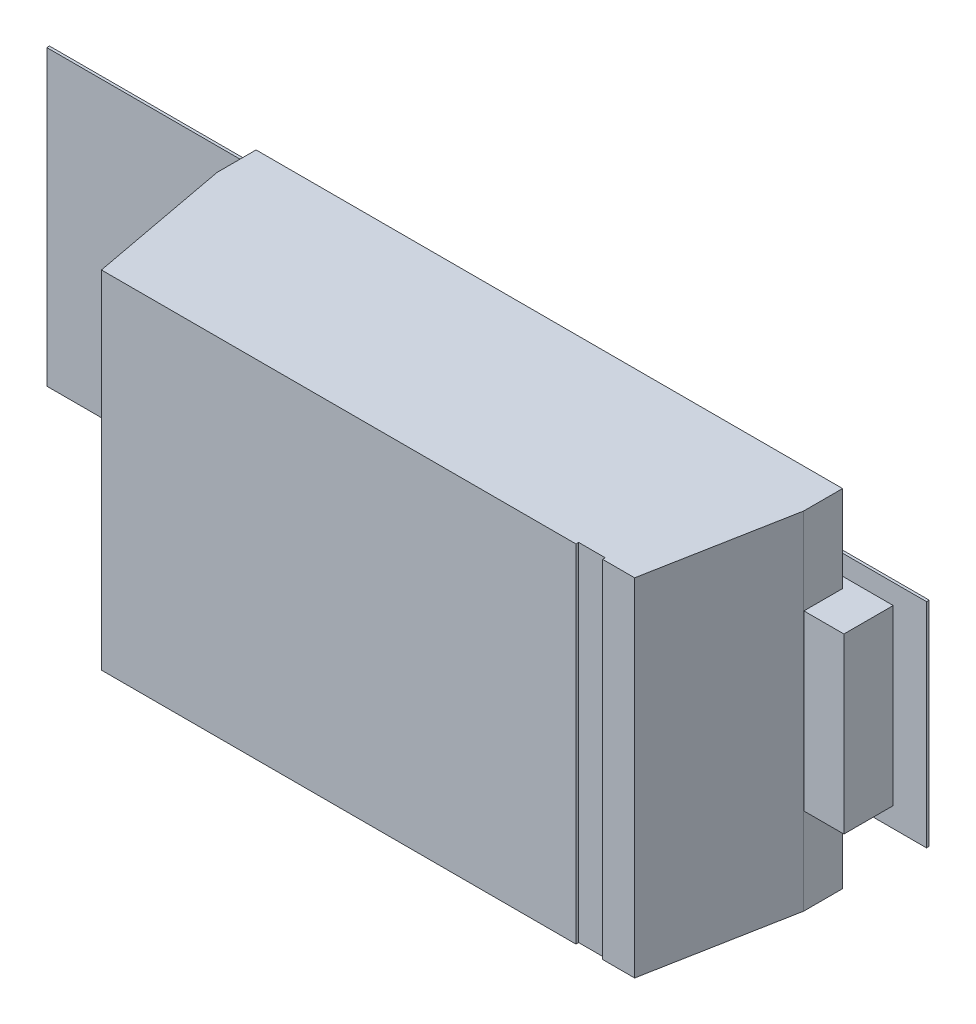
ISO-10303-21;
HEADER;
FILE_DESCRIPTION(('STEP AP214'),'2;1');
FILE_NAME('part.step','',(''),(''),'','','');
FILE_SCHEMA(('AUTOMOTIVE_DESIGN { 1 0 10303 214 1 1 1 1 }'));
ENDSEC;
DATA;
#1=APPLICATION_CONTEXT('core data for automotive mechanical design processes');
#2=APPLICATION_PROTOCOL_DEFINITION('international standard','automotive_design',2000,#1);
#3=PRODUCT_CONTEXT('',#1,'mechanical');
#4=PRODUCT('Part','Part','',(#3));
#5=PRODUCT_RELATED_PRODUCT_CATEGORY('part','',(#4));
#6=PRODUCT_DEFINITION_FORMATION('','',#4);
#7=PRODUCT_DEFINITION_CONTEXT('part definition',#1,'design');
#8=PRODUCT_DEFINITION('design','',#6,#7);
#9=PRODUCT_DEFINITION_SHAPE('','',#8);
#10=(LENGTH_UNIT() NAMED_UNIT(*) SI_UNIT(.MILLI.,.METRE.));
#11=(NAMED_UNIT(*) PLANE_ANGLE_UNIT() SI_UNIT($,.RADIAN.));
#12=(NAMED_UNIT(*) SI_UNIT($,.STERADIAN.) SOLID_ANGLE_UNIT());
#13=UNCERTAINTY_MEASURE_WITH_UNIT(LENGTH_MEASURE(1.E-05),#10,'distance_accuracy_value','');
#14=(GEOMETRIC_REPRESENTATION_CONTEXT(3) GLOBAL_UNCERTAINTY_ASSIGNED_CONTEXT((#13)) GLOBAL_UNIT_ASSIGNED_CONTEXT((#10,
#11,#12)) REPRESENTATION_CONTEXT('',''));
#15=CARTESIAN_POINT('',(0.,0.,0.));
#16=DIRECTION('',(0.,0.,1.));
#17=DIRECTION('',(1.,0.,0.));
#18=AXIS2_PLACEMENT_3D('',#15,#16,#17);
#19=CARTESIAN_POINT('',(-1.1,-0.65,0.2722));
#20=DIRECTION('',(0.982913837182173,0.,-0.184066261644595));
#21=DIRECTION('',(0.,-1.,0.));
#22=AXIS2_PLACEMENT_3D('',#19,#20,#21);
#23=PLANE('',#22);
#24=DIRECTION('',(0.,-1.,0.));
#25=VECTOR('',#24,1.);
#26=CARTESIAN_POINT('',(-1.1,0.65,0.2722));
#27=LINE('',#26,#25);
#28=CARTESIAN_POINT('',(-1.1,0.65,0.2722));
#29=VERTEX_POINT('',#28);
#30=CARTESIAN_POINT('',(-1.1,-0.65,0.2722));
#31=VERTEX_POINT('',#30);
#32=EDGE_CURVE('E323',#29,#31,#27,.T.);
#33=ORIENTED_EDGE('',*,*,#32,.T.);
#34=DIRECTION('',(0.184066261644595,0.,0.982913837182173));
#35=VECTOR('',#34,1.);
#36=CARTESIAN_POINT('',(-1.1,-0.65,0.2722));
#37=LINE('',#36,#35);
#38=CARTESIAN_POINT('',(-1.,-0.65,0.8062));
#39=VERTEX_POINT('',#38);
#40=EDGE_CURVE('E364',#31,#39,#37,.T.);
#41=ORIENTED_EDGE('',*,*,#40,.T.);
#42=DIRECTION('',(0.,1.,0.));
#43=VECTOR('',#42,1.);
#44=CARTESIAN_POINT('',(-1.,-0.65,0.8062));
#45=LINE('',#44,#43);
#46=CARTESIAN_POINT('',(-1.,0.65,0.8062));
#47=VERTEX_POINT('',#46);
#48=EDGE_CURVE('E422',#39,#47,#45,.T.);
#49=ORIENTED_EDGE('',*,*,#48,.T.);
#50=DIRECTION('',(0.184066261644595,0.,0.982913837182173));
#51=VECTOR('',#50,1.);
#52=CARTESIAN_POINT('',(-1.1,0.65,0.2722));
#53=LINE('',#52,#51);
#54=EDGE_CURVE('E363',#29,#47,#53,.T.);
#55=ORIENTED_EDGE('',*,*,#54,.F.);
#56=EDGE_LOOP('',(#33,#41,#49,#55));
#57=FACE_BOUND('',#56,.T.);
#58=ADVANCED_FACE('F17',(#57),#23,.F.);
#59=CARTESIAN_POINT('',(1.25,-0.325,0.0762));
#60=DIRECTION('',(1.,0.,0.));
#61=DIRECTION('',(0.,1.,0.));
#62=AXIS2_PLACEMENT_3D('',#59,#60,#61);
#63=PLANE('',#62);
#64=DIRECTION('',(0.,0.,1.));
#65=VECTOR('',#64,1.);
#66=CARTESIAN_POINT('',(1.25,0.325,0.0862));
#67=LINE('',#66,#65);
#68=CARTESIAN_POINT('',(1.25,0.325,0.0862));
#69=VERTEX_POINT('',#68);
#70=CARTESIAN_POINT('',(1.25,0.325,0.2712));
#71=VERTEX_POINT('',#70);
#72=EDGE_CURVE('E11',#69,#71,#67,.T.);
#73=ORIENTED_EDGE('',*,*,#72,.T.);
#74=DIRECTION('',(0.,1.,0.));
#75=VECTOR('',#74,1.);
#76=CARTESIAN_POINT('',(1.25,-0.325,0.2712));
#77=LINE('',#76,#75);
#78=CARTESIAN_POINT('',(1.25,-0.325,0.2712));
#79=VERTEX_POINT('',#78);
#80=EDGE_CURVE('E297',#79,#71,#77,.T.);
#81=ORIENTED_EDGE('',*,*,#80,.F.);
#82=DIRECTION('',(0.,0.,1.));
#83=VECTOR('',#82,1.);
#84=CARTESIAN_POINT('',(1.25,-0.325,0.0862));
#85=LINE('',#84,#83);
#86=CARTESIAN_POINT('',(1.25,-0.325,0.0862));
#87=VERTEX_POINT('',#86);
#88=EDGE_CURVE('E563',#87,#79,#85,.T.);
#89=ORIENTED_EDGE('',*,*,#88,.F.);
#90=DIRECTION('',(0.,1.,0.));
#91=VECTOR('',#90,1.);
#92=CARTESIAN_POINT('',(1.25,-0.325,0.0862));
#93=LINE('',#92,#91);
#94=EDGE_CURVE('E522',#87,#69,#93,.T.);
#95=ORIENTED_EDGE('',*,*,#94,.T.);
#96=EDGE_LOOP('',(#73,#81,#89,#95));
#97=FACE_BOUND('',#96,.T.);
#98=ADVANCED_FACE('F678',(#97),#63,.T.);
#99=CARTESIAN_POINT('',(1.25,0.325,0.0762));
#100=DIRECTION('',(0.,1.,0.));
#101=DIRECTION('',(1.,0.,0.));
#102=AXIS2_PLACEMENT_3D('',#99,#100,#101);
#103=PLANE('',#102);
#104=DIRECTION('',(0.,0.,1.));
#105=VECTOR('',#104,1.);
#106=CARTESIAN_POINT('',(0.6,0.325,0.0862));
#107=LINE('',#106,#105);
#108=CARTESIAN_POINT('',(0.6,0.325,0.0862));
#109=VERTEX_POINT('',#108);
#110=CARTESIAN_POINT('',(0.6,0.325,0.1262));
#111=VERTEX_POINT('',#110);
#112=EDGE_CURVE('E28',#109,#111,#107,.T.);
#113=ORIENTED_EDGE('',*,*,#112,.T.);
#114=DIRECTION('',(-1.,0.,0.));
#115=VECTOR('',#114,1.);
#116=CARTESIAN_POINT('',(1.1,0.325,0.1262));
#117=LINE('',#116,#115);
#118=CARTESIAN_POINT('',(1.1,0.325,0.1262));
#119=VERTEX_POINT('',#118);
#120=EDGE_CURVE('E425',#119,#111,#117,.T.);
#121=ORIENTED_EDGE('',*,*,#120,.F.);
#122=DIRECTION('',(0.,0.,1.));
#123=VECTOR('',#122,1.);
#124=CARTESIAN_POINT('',(1.1,0.325,0.1262));
#125=LINE('',#124,#123);
#126=CARTESIAN_POINT('',(1.1,0.325,0.2712));
#127=VERTEX_POINT('',#126);
#128=EDGE_CURVE('E567',#119,#127,#125,.T.);
#129=ORIENTED_EDGE('',*,*,#128,.T.);
#130=DIRECTION('',(-1.,0.,0.));
#131=VECTOR('',#130,1.);
#132=CARTESIAN_POINT('',(1.25,0.325,0.2712));
#133=LINE('',#132,#131);
#134=EDGE_CURVE('E324',#71,#127,#133,.T.);
#135=ORIENTED_EDGE('',*,*,#134,.F.);
#136=ORIENTED_EDGE('',*,*,#72,.F.);
#137=DIRECTION('',(-1.,0.,0.));
#138=VECTOR('',#137,1.);
#139=CARTESIAN_POINT('',(1.25,0.325,0.0862));
#140=LINE('',#139,#138);
#141=EDGE_CURVE('E641',#69,#109,#140,.T.);
#142=ORIENTED_EDGE('',*,*,#141,.T.);
#143=EDGE_LOOP('',(#113,#121,#129,#135,#136,#142));
#144=FACE_BOUND('',#143,.T.);
#145=ADVANCED_FACE('F670',(#144),#103,.T.);
#146=CARTESIAN_POINT('',(0.6,0.325,0.0762));
#147=DIRECTION('',(-1.,0.,0.));
#148=DIRECTION('',(0.,0.,1.));
#149=AXIS2_PLACEMENT_3D('',#146,#147,#148);
#150=PLANE('',#149);
#151=DIRECTION('',(0.,0.,1.));
#152=VECTOR('',#151,1.);
#153=CARTESIAN_POINT('',(0.6,-0.325,0.0862));
#154=LINE('',#153,#152);
#155=CARTESIAN_POINT('',(0.6,-0.325,0.0862));
#156=VERTEX_POINT('',#155);
#157=CARTESIAN_POINT('',(0.6,-0.325,0.1262));
#158=VERTEX_POINT('',#157);
#159=EDGE_CURVE('E340',#156,#158,#154,.T.);
#160=ORIENTED_EDGE('',*,*,#159,.T.);
#161=DIRECTION('',(0.,-1.,0.));
#162=VECTOR('',#161,1.);
#163=CARTESIAN_POINT('',(0.6,0.325,0.1262));
#164=LINE('',#163,#162);
#165=EDGE_CURVE('E496',#111,#158,#164,.T.);
#166=ORIENTED_EDGE('',*,*,#165,.F.);
#167=ORIENTED_EDGE('',*,*,#112,.F.);
#168=DIRECTION('',(0.,-1.,0.));
#169=VECTOR('',#168,1.);
#170=CARTESIAN_POINT('',(0.6,0.325,0.0862));
#171=LINE('',#170,#169);
#172=EDGE_CURVE('E384',#109,#156,#171,.T.);
#173=ORIENTED_EDGE('',*,*,#172,.T.);
#174=EDGE_LOOP('',(#160,#166,#167,#173));
#175=FACE_BOUND('',#174,.T.);
#176=ADVANCED_FACE('F746',(#175),#150,.T.);
#177=CARTESIAN_POINT('',(1.1,-0.65,0.1262));
#178=DIRECTION('',(0.,0.,1.));
#179=DIRECTION('',(1.,0.,0.));
#180=AXIS2_PLACEMENT_3D('',#177,#178,#179);
#181=PLANE('',#180);
#182=DIRECTION('',(0.,1.,0.));
#183=VECTOR('',#182,1.);
#184=CARTESIAN_POINT('',(0.05,-0.325,0.1262));
#185=LINE('',#184,#183);
#186=CARTESIAN_POINT('',(0.05,-0.325,0.1262));
#187=VERTEX_POINT('',#186);
#188=CARTESIAN_POINT('',(0.05,0.325,0.1262));
#189=VERTEX_POINT('',#188);
#190=EDGE_CURVE('E396',#187,#189,#185,.T.);
#191=ORIENTED_EDGE('',*,*,#190,.T.);
#192=DIRECTION('',(1.,0.,0.));
#193=VECTOR('',#192,1.);
#194=CARTESIAN_POINT('',(-1.1,0.325,0.1262));
#195=LINE('',#194,#193);
#196=CARTESIAN_POINT('',(-1.1,0.325,0.1262));
#197=VERTEX_POINT('',#196);
#198=EDGE_CURVE('E397',#197,#189,#195,.T.);
#199=ORIENTED_EDGE('',*,*,#198,.F.);
#200=DIRECTION('',(0.,-1.,0.));
#201=VECTOR('',#200,1.);
#202=CARTESIAN_POINT('',(-1.1,0.65,0.1262));
#203=LINE('',#202,#201);
#204=CARTESIAN_POINT('',(-1.1,0.65,0.1262));
#205=VERTEX_POINT('',#204);
#206=EDGE_CURVE('E404',#205,#197,#203,.T.);
#207=ORIENTED_EDGE('',*,*,#206,.F.);
#208=DIRECTION('',(-1.,0.,0.));
#209=VECTOR('',#208,1.);
#210=CARTESIAN_POINT('',(1.1,0.65,0.1262));
#211=LINE('',#210,#209);
#212=CARTESIAN_POINT('',(1.1,0.65,0.1262));
#213=VERTEX_POINT('',#212);
#214=EDGE_CURVE('E461',#213,#205,#211,.T.);
#215=ORIENTED_EDGE('',*,*,#214,.F.);
#216=DIRECTION('',(0.,1.,0.));
#217=VECTOR('',#216,1.);
#218=CARTESIAN_POINT('',(1.1,0.325,0.1262));
#219=LINE('',#218,#217);
#220=EDGE_CURVE('E21',#119,#213,#219,.T.);
#221=ORIENTED_EDGE('',*,*,#220,.F.);
#222=ORIENTED_EDGE('',*,*,#120,.T.);
#223=ORIENTED_EDGE('',*,*,#165,.T.);
#224=DIRECTION('',(-1.,0.,0.));
#225=VECTOR('',#224,1.);
#226=CARTESIAN_POINT('',(1.1,-0.325,0.1262));
#227=LINE('',#226,#225);
#228=CARTESIAN_POINT('',(1.1,-0.325,0.1262));
#229=VERTEX_POINT('',#228);
#230=EDGE_CURVE('E400',#229,#158,#227,.T.);
#231=ORIENTED_EDGE('',*,*,#230,.F.);
#232=DIRECTION('',(0.,1.,0.));
#233=VECTOR('',#232,1.);
#234=CARTESIAN_POINT('',(1.1,-0.65,0.1262));
#235=LINE('',#234,#233);
#236=CARTESIAN_POINT('',(1.1,-0.65,0.1262));
#237=VERTEX_POINT('',#236);
#238=EDGE_CURVE('E437',#237,#229,#235,.T.);
#239=ORIENTED_EDGE('',*,*,#238,.F.);
#240=DIRECTION('',(1.,0.,0.));
#241=VECTOR('',#240,1.);
#242=CARTESIAN_POINT('',(-1.1,-0.65,0.1262));
#243=LINE('',#242,#241);
#244=CARTESIAN_POINT('',(-1.1,-0.65,0.1262));
#245=VERTEX_POINT('',#244);
#246=EDGE_CURVE('E374',#245,#237,#243,.T.);
#247=ORIENTED_EDGE('',*,*,#246,.F.);
#248=DIRECTION('',(0.,-1.,0.));
#249=VECTOR('',#248,1.);
#250=CARTESIAN_POINT('',(-1.1,-0.325,0.1262));
#251=LINE('',#250,#249);
#252=CARTESIAN_POINT('',(-1.1,-0.325,0.1262));
#253=VERTEX_POINT('',#252);
#254=EDGE_CURVE('E322',#253,#245,#251,.T.);
#255=ORIENTED_EDGE('',*,*,#254,.F.);
#256=DIRECTION('',(1.,0.,0.));
#257=VECTOR('',#256,1.);
#258=CARTESIAN_POINT('',(-1.1,-0.325,0.1262));
#259=LINE('',#258,#257);
#260=EDGE_CURVE('E308',#253,#187,#259,.T.);
#261=ORIENTED_EDGE('',*,*,#260,.T.);
#262=EDGE_LOOP('',(#191,#199,#207,#215,#221,#222,#223,#231,#239,#247,#255,#261));
#263=FACE_BOUND('',#262,.T.);
#264=ADVANCED_FACE('F614',(#263),#181,.F.);
#265=CARTESIAN_POINT('',(-1.1,0.65,0.0762));
#266=DIRECTION('',(-1.,0.,0.));
#267=DIRECTION('',(0.,0.,1.));
#268=AXIS2_PLACEMENT_3D('',#265,#266,#267);
#269=PLANE('',#268);
#270=ORIENTED_EDGE('',*,*,#254,.T.);
#271=DIRECTION('',(0.,0.,1.));
#272=VECTOR('',#271,1.);
#273=CARTESIAN_POINT('',(-1.1,-0.65,0.1262));
#274=LINE('',#273,#272);
#275=EDGE_CURVE('E367',#245,#31,#274,.T.);
#276=ORIENTED_EDGE('',*,*,#275,.T.);
#277=ORIENTED_EDGE('',*,*,#32,.F.);
#278=DIRECTION('',(0.,0.,1.));
#279=VECTOR('',#278,1.);
#280=CARTESIAN_POINT('',(-1.1,0.65,0.1262));
#281=LINE('',#280,#279);
#282=EDGE_CURVE('E457',#205,#29,#281,.T.);
#283=ORIENTED_EDGE('',*,*,#282,.F.);
#284=ORIENTED_EDGE('',*,*,#206,.T.);
#285=DIRECTION('',(0.,0.,1.));
#286=VECTOR('',#285,1.);
#287=CARTESIAN_POINT('',(-1.1,0.325,0.1262));
#288=LINE('',#287,#286);
#289=CARTESIAN_POINT('',(-1.1,0.325,0.2712));
#290=VERTEX_POINT('',#289);
#291=EDGE_CURVE('E292',#197,#290,#288,.T.);
#292=ORIENTED_EDGE('',*,*,#291,.T.);
#293=DIRECTION('',(0.,1.,0.));
#294=VECTOR('',#293,1.);
#295=CARTESIAN_POINT('',(-1.1,-0.325,0.2712));
#296=LINE('',#295,#294);
#297=CARTESIAN_POINT('',(-1.1,-0.325,0.2712));
#298=VERTEX_POINT('',#297);
#299=EDGE_CURVE('E285',#298,#290,#296,.T.);
#300=ORIENTED_EDGE('',*,*,#299,.F.);
#301=DIRECTION('',(0.,0.,1.));
#302=VECTOR('',#301,1.);
#303=CARTESIAN_POINT('',(-1.1,-0.325,0.1262));
#304=LINE('',#303,#302);
#305=EDGE_CURVE('E289',#253,#298,#304,.T.);
#306=ORIENTED_EDGE('',*,*,#305,.F.);
#307=EDGE_LOOP('',(#270,#276,#277,#283,#284,#292,#300,#306));
#308=FACE_BOUND('',#307,.T.);
#309=ADVANCED_FACE('F287',(#308),#269,.T.);
#310=CARTESIAN_POINT('',(0.,0.,0.2712));
#311=DIRECTION('',(0.,0.,1.));
#312=DIRECTION('',(1.,0.,0.));
#313=AXIS2_PLACEMENT_3D('',#310,#311,#312);
#314=PLANE('',#313);
#315=ORIENTED_EDGE('',*,*,#80,.T.);
#316=ORIENTED_EDGE('',*,*,#134,.T.);
#317=DIRECTION('',(0.,1.,0.));
#318=VECTOR('',#317,1.);
#319=CARTESIAN_POINT('',(1.1,-0.325,0.2712));
#320=LINE('',#319,#318);
#321=CARTESIAN_POINT('',(1.1,-0.325,0.2712));
#322=VERTEX_POINT('',#321);
#323=EDGE_CURVE('E435',#322,#127,#320,.T.);
#324=ORIENTED_EDGE('',*,*,#323,.F.);
#325=DIRECTION('',(1.,0.,0.));
#326=VECTOR('',#325,1.);
#327=CARTESIAN_POINT('',(1.1,-0.325,0.2712));
#328=LINE('',#327,#326);
#329=EDGE_CURVE('E495',#322,#79,#328,.T.);
#330=ORIENTED_EDGE('',*,*,#329,.T.);
#331=EDGE_LOOP('',(#315,#316,#324,#330));
#332=FACE_BOUND('',#331,.T.);
#333=ADVANCED_FACE('F674',(#332),#314,.T.);
#334=CARTESIAN_POINT('',(0.,0.,0.2712));
#335=DIRECTION('',(0.,0.,1.));
#336=DIRECTION('',(1.,0.,0.));
#337=AXIS2_PLACEMENT_3D('',#334,#335,#336);
#338=PLANE('',#337);
#339=ORIENTED_EDGE('',*,*,#299,.T.);
#340=DIRECTION('',(-1.,0.,0.));
#341=VECTOR('',#340,1.);
#342=CARTESIAN_POINT('',(-1.1,0.325,0.2712));
#343=LINE('',#342,#341);
#344=CARTESIAN_POINT('',(-1.25,0.325,0.2712));
#345=VERTEX_POINT('',#344);
#346=EDGE_CURVE('E326',#290,#345,#343,.T.);
#347=ORIENTED_EDGE('',*,*,#346,.T.);
#348=DIRECTION('',(0.,-1.,0.));
#349=VECTOR('',#348,1.);
#350=CARTESIAN_POINT('',(-1.25,0.325,0.2712));
#351=LINE('',#350,#349);
#352=CARTESIAN_POINT('',(-1.25,-0.325,0.2712));
#353=VERTEX_POINT('',#352);
#354=EDGE_CURVE('E302',#345,#353,#351,.T.);
#355=ORIENTED_EDGE('',*,*,#354,.T.);
#356=DIRECTION('',(1.,0.,0.));
#357=VECTOR('',#356,1.);
#358=CARTESIAN_POINT('',(-1.25,-0.325,0.2712));
#359=LINE('',#358,#357);
#360=EDGE_CURVE('E298',#353,#298,#359,.T.);
#361=ORIENTED_EDGE('',*,*,#360,.T.);
#362=EDGE_LOOP('',(#339,#347,#355,#361));
#363=FACE_BOUND('',#362,.T.);
#364=ADVANCED_FACE('F301',(#363),#338,.T.);
#365=CARTESIAN_POINT('',(-1.25,-0.325,0.0762));
#366=DIRECTION('',(0.,-1.,0.));
#367=DIRECTION('',(0.,0.,-1.));
#368=AXIS2_PLACEMENT_3D('',#365,#366,#367);
#369=PLANE('',#368);
#370=DIRECTION('',(0.,0.,1.));
#371=VECTOR('',#370,1.);
#372=CARTESIAN_POINT('',(0.05,-0.325,0.0862));
#373=LINE('',#372,#371);
#374=CARTESIAN_POINT('',(0.05,-0.325,0.0862));
#375=VERTEX_POINT('',#374);
#376=EDGE_CURVE('E93',#375,#187,#373,.T.);
#377=ORIENTED_EDGE('',*,*,#376,.T.);
#378=ORIENTED_EDGE('',*,*,#260,.F.);
#379=ORIENTED_EDGE('',*,*,#305,.T.);
#380=ORIENTED_EDGE('',*,*,#360,.F.);
#381=DIRECTION('',(0.,0.,1.));
#382=VECTOR('',#381,1.);
#383=CARTESIAN_POINT('',(-1.25,-0.325,0.0862));
#384=LINE('',#383,#382);
#385=CARTESIAN_POINT('',(-1.25,-0.325,0.0862));
#386=VERTEX_POINT('',#385);
#387=EDGE_CURVE('E378',#386,#353,#384,.T.);
#388=ORIENTED_EDGE('',*,*,#387,.F.);
#389=DIRECTION('',(1.,0.,0.));
#390=VECTOR('',#389,1.);
#391=CARTESIAN_POINT('',(-1.25,-0.325,0.0862));
#392=LINE('',#391,#390);
#393=EDGE_CURVE('E538',#386,#375,#392,.T.);
#394=ORIENTED_EDGE('',*,*,#393,.T.);
#395=EDGE_LOOP('',(#377,#378,#379,#380,#388,#394));
#396=FACE_BOUND('',#395,.T.);
#397=ADVANCED_FACE('F307',(#396),#369,.T.);
#398=CARTESIAN_POINT('',(0.05,-0.325,0.0762));
#399=DIRECTION('',(1.,0.,0.));
#400=DIRECTION('',(0.,1.,0.));
#401=AXIS2_PLACEMENT_3D('',#398,#399,#400);
#402=PLANE('',#401);
#403=DIRECTION('',(0.,0.,1.));
#404=VECTOR('',#403,1.);
#405=CARTESIAN_POINT('',(0.05,0.325,0.0862));
#406=LINE('',#405,#404);
#407=CARTESIAN_POINT('',(0.05,0.325,0.0862));
#408=VERTEX_POINT('',#407);
#409=EDGE_CURVE('E392',#408,#189,#406,.T.);
#410=ORIENTED_EDGE('',*,*,#409,.T.);
#411=ORIENTED_EDGE('',*,*,#190,.F.);
#412=ORIENTED_EDGE('',*,*,#376,.F.);
#413=DIRECTION('',(0.,1.,0.));
#414=VECTOR('',#413,1.);
#415=CARTESIAN_POINT('',(0.05,-0.325,0.0862));
#416=LINE('',#415,#414);
#417=EDGE_CURVE('E542',#375,#408,#416,.T.);
#418=ORIENTED_EDGE('',*,*,#417,.T.);
#419=EDGE_LOOP('',(#410,#411,#412,#418));
#420=FACE_BOUND('',#419,.T.);
#421=ADVANCED_FACE('F814',(#420),#402,.T.);
#422=CARTESIAN_POINT('',(0.05,0.325,0.0762));
#423=DIRECTION('',(0.,1.,0.));
#424=DIRECTION('',(1.,0.,0.));
#425=AXIS2_PLACEMENT_3D('',#422,#423,#424);
#426=PLANE('',#425);
#427=DIRECTION('',(0.,0.,1.));
#428=VECTOR('',#427,1.);
#429=CARTESIAN_POINT('',(-1.25,0.325,0.0862));
#430=LINE('',#429,#428);
#431=CARTESIAN_POINT('',(-1.25,0.325,0.0862));
#432=VERTEX_POINT('',#431);
#433=EDGE_CURVE('E110',#432,#345,#430,.T.);
#434=ORIENTED_EDGE('',*,*,#433,.T.);
#435=ORIENTED_EDGE('',*,*,#346,.F.);
#436=ORIENTED_EDGE('',*,*,#291,.F.);
#437=ORIENTED_EDGE('',*,*,#198,.T.);
#438=ORIENTED_EDGE('',*,*,#409,.F.);
#439=DIRECTION('',(-1.,0.,0.));
#440=VECTOR('',#439,1.);
#441=CARTESIAN_POINT('',(0.05,0.325,0.0862));
#442=LINE('',#441,#440);
#443=EDGE_CURVE('E516',#408,#432,#442,.T.);
#444=ORIENTED_EDGE('',*,*,#443,.T.);
#445=EDGE_LOOP('',(#434,#435,#436,#437,#438,#444));
#446=FACE_BOUND('',#445,.T.);
#447=ADVANCED_FACE('F817',(#446),#426,.T.);
#448=CARTESIAN_POINT('',(-1.25,0.325,0.0762));
#449=DIRECTION('',(-1.,0.,0.));
#450=DIRECTION('',(0.,0.,1.));
#451=AXIS2_PLACEMENT_3D('',#448,#449,#450);
#452=PLANE('',#451);
#453=ORIENTED_EDGE('',*,*,#387,.T.);
#454=ORIENTED_EDGE('',*,*,#354,.F.);
#455=ORIENTED_EDGE('',*,*,#433,.F.);
#456=DIRECTION('',(0.,-1.,0.));
#457=VECTOR('',#456,1.);
#458=CARTESIAN_POINT('',(-1.25,0.325,0.0862));
#459=LINE('',#458,#457);
#460=EDGE_CURVE('E541',#432,#386,#459,.T.);
#461=ORIENTED_EDGE('',*,*,#460,.T.);
#462=EDGE_LOOP('',(#453,#454,#455,#461));
#463=FACE_BOUND('',#462,.T.);
#464=ADVANCED_FACE('F857',(#463),#452,.T.);
#465=CARTESIAN_POINT('',(1.375,0.4,0.0762));
#466=DIRECTION('',(0.,1.,0.));
#467=DIRECTION('',(1.,0.,0.));
#468=AXIS2_PLACEMENT_3D('',#465,#466,#467);
#469=PLANE('',#468);
#470=DIRECTION('',(0.,0.,1.));
#471=VECTOR('',#470,1.);
#472=CARTESIAN_POINT('',(0.575,0.4,0.0762));
#473=LINE('',#472,#471);
#474=CARTESIAN_POINT('',(0.575,0.4,0.0762));
#475=VERTEX_POINT('',#474);
#476=CARTESIAN_POINT('',(0.575,0.4,0.0862));
#477=VERTEX_POINT('',#476);
#478=EDGE_CURVE('E410',#475,#477,#473,.T.);
#479=ORIENTED_EDGE('',*,*,#478,.T.);
#480=DIRECTION('',(-1.,0.,0.));
#481=VECTOR('',#480,1.);
#482=CARTESIAN_POINT('',(1.375,0.4,0.0862));
#483=LINE('',#482,#481);
#484=CARTESIAN_POINT('',(1.375,0.4,0.0862));
#485=VERTEX_POINT('',#484);
#486=EDGE_CURVE('E409',#485,#477,#483,.T.);
#487=ORIENTED_EDGE('',*,*,#486,.F.);
#488=DIRECTION('',(0.,0.,1.));
#489=VECTOR('',#488,1.);
#490=CARTESIAN_POINT('',(1.375,0.4,0.0762));
#491=LINE('',#490,#489);
#492=CARTESIAN_POINT('',(1.375,0.4,0.0762));
#493=VERTEX_POINT('',#492);
#494=EDGE_CURVE('E375',#493,#485,#491,.T.);
#495=ORIENTED_EDGE('',*,*,#494,.F.);
#496=DIRECTION('',(-1.,0.,0.));
#497=VECTOR('',#496,1.);
#498=CARTESIAN_POINT('',(1.375,0.4,0.0762));
#499=LINE('',#498,#497);
#500=EDGE_CURVE('E451',#493,#475,#499,.T.);
#501=ORIENTED_EDGE('',*,*,#500,.T.);
#502=EDGE_LOOP('',(#479,#487,#495,#501));
#503=FACE_BOUND('',#502,.T.);
#504=ADVANCED_FACE('F853',(#503),#469,.T.);
#505=CARTESIAN_POINT('',(1.375,-0.4,0.0762));
#506=DIRECTION('',(1.,0.,0.));
#507=DIRECTION('',(0.,1.,0.));
#508=AXIS2_PLACEMENT_3D('',#505,#506,#507);
#509=PLANE('',#508);
#510=ORIENTED_EDGE('',*,*,#494,.T.);
#511=DIRECTION('',(0.,1.,0.));
#512=VECTOR('',#511,1.);
#513=CARTESIAN_POINT('',(1.375,-0.4,0.0862));
#514=LINE('',#513,#512);
#515=CARTESIAN_POINT('',(1.375,-0.4,0.0862));
#516=VERTEX_POINT('',#515);
#517=EDGE_CURVE('E405',#516,#485,#514,.T.);
#518=ORIENTED_EDGE('',*,*,#517,.F.);
#519=DIRECTION('',(0.,0.,1.));
#520=VECTOR('',#519,1.);
#521=CARTESIAN_POINT('',(1.375,-0.4,0.0762));
#522=LINE('',#521,#520);
#523=CARTESIAN_POINT('',(1.375,-0.4,0.0762));
#524=VERTEX_POINT('',#523);
#525=EDGE_CURVE('E379',#524,#516,#522,.T.);
#526=ORIENTED_EDGE('',*,*,#525,.F.);
#527=DIRECTION('',(0.,1.,0.));
#528=VECTOR('',#527,1.);
#529=CARTESIAN_POINT('',(1.375,-0.4,0.0762));
#530=LINE('',#529,#528);
#531=EDGE_CURVE('E417',#524,#493,#530,.T.);
#532=ORIENTED_EDGE('',*,*,#531,.T.);
#533=EDGE_LOOP('',(#510,#518,#526,#532));
#534=FACE_BOUND('',#533,.T.);
#535=ADVANCED_FACE('F827',(#534),#509,.T.);
#536=CARTESIAN_POINT('',(0.575,-0.4,0.0762));
#537=DIRECTION('',(0.,-1.,0.));
#538=DIRECTION('',(0.,0.,-1.));
#539=AXIS2_PLACEMENT_3D('',#536,#537,#538);
#540=PLANE('',#539);
#541=ORIENTED_EDGE('',*,*,#525,.T.);
#542=DIRECTION('',(1.,0.,0.));
#543=VECTOR('',#542,1.);
#544=CARTESIAN_POINT('',(0.575,-0.4,0.0862));
#545=LINE('',#544,#543);
#546=CARTESIAN_POINT('',(0.575,-0.4,0.0862));
#547=VERTEX_POINT('',#546);
#548=EDGE_CURVE('E339',#547,#516,#545,.T.);
#549=ORIENTED_EDGE('',*,*,#548,.F.);
#550=DIRECTION('',(0.,0.,1.));
#551=VECTOR('',#550,1.);
#552=CARTESIAN_POINT('',(0.575,-0.4,0.0762));
#553=LINE('',#552,#551);
#554=CARTESIAN_POINT('',(0.575,-0.4,0.0762));
#555=VERTEX_POINT('',#554);
#556=EDGE_CURVE('E320',#555,#547,#553,.T.);
#557=ORIENTED_EDGE('',*,*,#556,.F.);
#558=DIRECTION('',(1.,0.,0.));
#559=VECTOR('',#558,1.);
#560=CARTESIAN_POINT('',(0.575,-0.4,0.0762));
#561=LINE('',#560,#559);
#562=EDGE_CURVE('E357',#555,#524,#561,.T.);
#563=ORIENTED_EDGE('',*,*,#562,.T.);
#564=EDGE_LOOP('',(#541,#549,#557,#563));
#565=FACE_BOUND('',#564,.T.);
#566=ADVANCED_FACE('F809',(#565),#540,.T.);
#567=CARTESIAN_POINT('',(-1.925,0.55,0.0762));
#568=DIRECTION('',(-1.,0.,0.));
#569=DIRECTION('',(0.,0.,1.));
#570=AXIS2_PLACEMENT_3D('',#567,#568,#569);
#571=PLANE('',#570);
#572=DIRECTION('',(0.,0.,1.));
#573=VECTOR('',#572,1.);
#574=CARTESIAN_POINT('',(-1.925,-0.55,0.0762));
#575=LINE('',#574,#573);
#576=CARTESIAN_POINT('',(-1.925,-0.55,0.0762));
#577=VERTEX_POINT('',#576);
#578=CARTESIAN_POINT('',(-1.925,-0.55,0.0862));
#579=VERTEX_POINT('',#578);
#580=EDGE_CURVE('E453',#577,#579,#575,.T.);
#581=ORIENTED_EDGE('',*,*,#580,.T.);
#582=DIRECTION('',(0.,-1.,0.));
#583=VECTOR('',#582,1.);
#584=CARTESIAN_POINT('',(-1.925,0.55,0.0862));
#585=LINE('',#584,#583);
#586=CARTESIAN_POINT('',(-1.925,0.55,0.0862));
#587=VERTEX_POINT('',#586);
#588=EDGE_CURVE('E380',#587,#579,#585,.T.);
#589=ORIENTED_EDGE('',*,*,#588,.F.);
#590=DIRECTION('',(0.,0.,1.));
#591=VECTOR('',#590,1.);
#592=CARTESIAN_POINT('',(-1.925,0.55,0.0762));
#593=LINE('',#592,#591);
#594=CARTESIAN_POINT('',(-1.925,0.55,0.0762));
#595=VERTEX_POINT('',#594);
#596=EDGE_CURVE('E353',#595,#587,#593,.T.);
#597=ORIENTED_EDGE('',*,*,#596,.F.);
#598=DIRECTION('',(0.,-1.,0.));
#599=VECTOR('',#598,1.);
#600=CARTESIAN_POINT('',(-1.925,0.55,0.0762));
#601=LINE('',#600,#599);
#602=EDGE_CURVE('E452',#595,#577,#601,.T.);
#603=ORIENTED_EDGE('',*,*,#602,.T.);
#604=EDGE_LOOP('',(#581,#589,#597,#603));
#605=FACE_BOUND('',#604,.T.);
#606=ADVANCED_FACE('F798',(#605),#571,.T.);
#607=CARTESIAN_POINT('',(-1.925,-0.55,0.0762));
#608=DIRECTION('',(0.,-1.,0.));
#609=DIRECTION('',(0.,0.,-1.));
#610=AXIS2_PLACEMENT_3D('',#607,#608,#609);
#611=PLANE('',#610);
#612=DIRECTION('',(0.,0.,1.));
#613=VECTOR('',#612,1.);
#614=CARTESIAN_POINT('',(0.075,-0.55,0.0762));
#615=LINE('',#614,#613);
#616=CARTESIAN_POINT('',(0.075,-0.55,0.0762));
#617=VERTEX_POINT('',#616);
#618=CARTESIAN_POINT('',(0.075,-0.55,0.0862));
#619=VERTEX_POINT('',#618);
#620=EDGE_CURVE('E456',#617,#619,#615,.T.);
#621=ORIENTED_EDGE('',*,*,#620,.T.);
#622=DIRECTION('',(1.,0.,0.));
#623=VECTOR('',#622,1.);
#624=CARTESIAN_POINT('',(-1.925,-0.55,0.0862));
#625=LINE('',#624,#623);
#626=EDGE_CURVE('E346',#579,#619,#625,.T.);
#627=ORIENTED_EDGE('',*,*,#626,.F.);
#628=ORIENTED_EDGE('',*,*,#580,.F.);
#629=DIRECTION('',(1.,0.,0.));
#630=VECTOR('',#629,1.);
#631=CARTESIAN_POINT('',(-1.925,-0.55,0.0762));
#632=LINE('',#631,#630);
#633=EDGE_CURVE('E474',#577,#617,#632,.T.);
#634=ORIENTED_EDGE('',*,*,#633,.T.);
#635=EDGE_LOOP('',(#621,#627,#628,#634));
#636=FACE_BOUND('',#635,.T.);
#637=ADVANCED_FACE('F788',(#636),#611,.T.);
#638=CARTESIAN_POINT('',(0.075,-0.55,0.0762));
#639=DIRECTION('',(1.,0.,0.));
#640=DIRECTION('',(0.,1.,0.));
#641=AXIS2_PLACEMENT_3D('',#638,#639,#640);
#642=PLANE('',#641);
#643=DIRECTION('',(0.,0.,1.));
#644=VECTOR('',#643,1.);
#645=CARTESIAN_POINT('',(0.075,0.55,0.0762));
#646=LINE('',#645,#644);
#647=CARTESIAN_POINT('',(0.075,0.55,0.0762));
#648=VERTEX_POINT('',#647);
#649=CARTESIAN_POINT('',(0.075,0.55,0.0862));
#650=VERTEX_POINT('',#649);
#651=EDGE_CURVE('E356',#648,#650,#646,.T.);
#652=ORIENTED_EDGE('',*,*,#651,.T.);
#653=DIRECTION('',(0.,1.,0.));
#654=VECTOR('',#653,1.);
#655=CARTESIAN_POINT('',(0.075,-0.55,0.0862));
#656=LINE('',#655,#654);
#657=EDGE_CURVE('E341',#619,#650,#656,.T.);
#658=ORIENTED_EDGE('',*,*,#657,.F.);
#659=ORIENTED_EDGE('',*,*,#620,.F.);
#660=DIRECTION('',(0.,1.,0.));
#661=VECTOR('',#660,1.);
#662=CARTESIAN_POINT('',(0.075,-0.55,0.0762));
#663=LINE('',#662,#661);
#664=EDGE_CURVE('E470',#617,#648,#663,.T.);
#665=ORIENTED_EDGE('',*,*,#664,.T.);
#666=EDGE_LOOP('',(#652,#658,#659,#665));
#667=FACE_BOUND('',#666,.T.);
#668=ADVANCED_FACE('F780',(#667),#642,.T.);
#669=CARTESIAN_POINT('',(0.075,0.55,0.0762));
#670=DIRECTION('',(0.,1.,0.));
#671=DIRECTION('',(1.,0.,0.));
#672=AXIS2_PLACEMENT_3D('',#669,#670,#671);
#673=PLANE('',#672);
#674=ORIENTED_EDGE('',*,*,#596,.T.);
#675=DIRECTION('',(-1.,0.,0.));
#676=VECTOR('',#675,1.);
#677=CARTESIAN_POINT('',(0.075,0.55,0.0862));
#678=LINE('',#677,#676);
#679=EDGE_CURVE('E345',#650,#587,#678,.T.);
#680=ORIENTED_EDGE('',*,*,#679,.F.);
#681=ORIENTED_EDGE('',*,*,#651,.F.);
#682=DIRECTION('',(-1.,0.,0.));
#683=VECTOR('',#682,1.);
#684=CARTESIAN_POINT('',(0.075,0.55,0.0762));
#685=LINE('',#684,#683);
#686=EDGE_CURVE('E447',#648,#595,#685,.T.);
#687=ORIENTED_EDGE('',*,*,#686,.T.);
#688=EDGE_LOOP('',(#674,#680,#681,#687));
#689=FACE_BOUND('',#688,.T.);
#690=ADVANCED_FACE('F778',(#689),#673,.T.);
#691=CARTESIAN_POINT('',(0.,0.,0.0762));
#692=DIRECTION('',(0.,0.,1.));
#693=DIRECTION('',(1.,0.,0.));
#694=AXIS2_PLACEMENT_3D('',#691,#692,#693);
#695=PLANE('',#694);
#696=ORIENTED_EDGE('',*,*,#500,.F.);
#697=ORIENTED_EDGE('',*,*,#531,.F.);
#698=ORIENTED_EDGE('',*,*,#562,.F.);
#699=DIRECTION('',(0.,-1.,0.));
#700=VECTOR('',#699,1.);
#701=CARTESIAN_POINT('',(0.575,0.4,0.0762));
#702=LINE('',#701,#700);
#703=EDGE_CURVE('E413',#475,#555,#702,.T.);
#704=ORIENTED_EDGE('',*,*,#703,.F.);
#705=EDGE_LOOP('',(#696,#697,#698,#704));
#706=FACE_BOUND('',#705,.T.);
#707=ADVANCED_FACE('F19',(#706),#695,.F.);
#708=CARTESIAN_POINT('',(0.,0.,0.0762));
#709=DIRECTION('',(0.,0.,1.));
#710=DIRECTION('',(1.,0.,0.));
#711=AXIS2_PLACEMENT_3D('',#708,#709,#710);
#712=PLANE('',#711);
#713=ORIENTED_EDGE('',*,*,#664,.F.);
#714=ORIENTED_EDGE('',*,*,#633,.F.);
#715=ORIENTED_EDGE('',*,*,#602,.F.);
#716=ORIENTED_EDGE('',*,*,#686,.F.);
#717=EDGE_LOOP('',(#713,#714,#715,#716));
#718=FACE_BOUND('',#717,.T.);
#719=ADVANCED_FACE('F774',(#718),#712,.F.);
#720=CARTESIAN_POINT('',(0.575,0.4,0.0762));
#721=DIRECTION('',(-1.,0.,0.));
#722=DIRECTION('',(0.,0.,1.));
#723=AXIS2_PLACEMENT_3D('',#720,#721,#722);
#724=PLANE('',#723);
#725=ORIENTED_EDGE('',*,*,#556,.T.);
#726=DIRECTION('',(0.,-1.,0.));
#727=VECTOR('',#726,1.);
#728=CARTESIAN_POINT('',(0.575,0.4,0.0862));
#729=LINE('',#728,#727);
#730=EDGE_CURVE('E506',#477,#547,#729,.T.);
#731=ORIENTED_EDGE('',*,*,#730,.F.);
#732=ORIENTED_EDGE('',*,*,#478,.F.);
#733=ORIENTED_EDGE('',*,*,#703,.T.);
#734=EDGE_LOOP('',(#725,#731,#732,#733));
#735=FACE_BOUND('',#734,.T.);
#736=ADVANCED_FACE('F772',(#735),#724,.T.);
#737=CARTESIAN_POINT('',(0.,0.,0.0862));
#738=DIRECTION('',(0.,0.,1.));
#739=DIRECTION('',(1.,0.,0.));
#740=AXIS2_PLACEMENT_3D('',#737,#738,#739);
#741=PLANE('',#740);
#742=ORIENTED_EDGE('',*,*,#443,.F.);
#743=ORIENTED_EDGE('',*,*,#417,.F.);
#744=ORIENTED_EDGE('',*,*,#393,.F.);
#745=ORIENTED_EDGE('',*,*,#460,.F.);
#746=EDGE_LOOP('',(#742,#743,#744,#745));
#747=FACE_BOUND('',#746,.T.);
#748=ORIENTED_EDGE('',*,*,#588,.T.);
#749=ORIENTED_EDGE('',*,*,#626,.T.);
#750=ORIENTED_EDGE('',*,*,#657,.T.);
#751=ORIENTED_EDGE('',*,*,#679,.T.);
#752=EDGE_LOOP('',(#748,#749,#750,#751));
#753=FACE_BOUND('',#752,.T.);
#754=ADVANCED_FACE('F758',(#747,#753),#741,.T.);
#755=CARTESIAN_POINT('',(0.,0.,0.0862));
#756=DIRECTION('',(0.,0.,1.));
#757=DIRECTION('',(1.,0.,0.));
#758=AXIS2_PLACEMENT_3D('',#755,#756,#757);
#759=PLANE('',#758);
#760=ORIENTED_EDGE('',*,*,#141,.F.);
#761=ORIENTED_EDGE('',*,*,#94,.F.);
#762=DIRECTION('',(1.,0.,0.));
#763=VECTOR('',#762,1.);
#764=CARTESIAN_POINT('',(0.6,-0.325,0.0862));
#765=LINE('',#764,#763);
#766=EDGE_CURVE('E335',#156,#87,#765,.T.);
#767=ORIENTED_EDGE('',*,*,#766,.F.);
#768=ORIENTED_EDGE('',*,*,#172,.F.);
#769=EDGE_LOOP('',(#760,#761,#767,#768));
#770=FACE_BOUND('',#769,.T.);
#771=ORIENTED_EDGE('',*,*,#548,.T.);
#772=ORIENTED_EDGE('',*,*,#517,.T.);
#773=ORIENTED_EDGE('',*,*,#486,.T.);
#774=ORIENTED_EDGE('',*,*,#730,.T.);
#775=EDGE_LOOP('',(#771,#772,#773,#774));
#776=FACE_BOUND('',#775,.T.);
#777=ADVANCED_FACE('F741',(#770,#776),#759,.T.);
#778=CARTESIAN_POINT('',(0.6,-0.325,0.0762));
#779=DIRECTION('',(0.,-1.,0.));
#780=DIRECTION('',(0.,0.,-1.));
#781=AXIS2_PLACEMENT_3D('',#778,#779,#780);
#782=PLANE('',#781);
#783=ORIENTED_EDGE('',*,*,#88,.T.);
#784=ORIENTED_EDGE('',*,*,#329,.F.);
#785=DIRECTION('',(0.,0.,1.));
#786=VECTOR('',#785,1.);
#787=CARTESIAN_POINT('',(1.1,-0.325,0.1262));
#788=LINE('',#787,#786);
#789=EDGE_CURVE('E441',#229,#322,#788,.T.);
#790=ORIENTED_EDGE('',*,*,#789,.F.);
#791=ORIENTED_EDGE('',*,*,#230,.T.);
#792=ORIENTED_EDGE('',*,*,#159,.F.);
#793=ORIENTED_EDGE('',*,*,#766,.T.);
#794=EDGE_LOOP('',(#783,#784,#790,#791,#792,#793));
#795=FACE_BOUND('',#794,.T.);
#796=ADVANCED_FACE('F748',(#795),#782,.T.);
#797=CARTESIAN_POINT('',(1.1,-0.65,0.0762));
#798=DIRECTION('',(1.,0.,0.));
#799=DIRECTION('',(0.,1.,0.));
#800=AXIS2_PLACEMENT_3D('',#797,#798,#799);
#801=PLANE('',#800);
#802=ORIENTED_EDGE('',*,*,#323,.T.);
#803=ORIENTED_EDGE('',*,*,#128,.F.);
#804=ORIENTED_EDGE('',*,*,#220,.T.);
#805=DIRECTION('',(0.,0.,1.));
#806=VECTOR('',#805,1.);
#807=CARTESIAN_POINT('',(1.1,0.65,0.1262));
#808=LINE('',#807,#806);
#809=CARTESIAN_POINT('',(1.1,0.65,0.2722));
#810=VERTEX_POINT('',#809);
#811=EDGE_CURVE('E532',#213,#810,#808,.T.);
#812=ORIENTED_EDGE('',*,*,#811,.T.);
#813=DIRECTION('',(0.,1.,0.));
#814=VECTOR('',#813,1.);
#815=CARTESIAN_POINT('',(1.1,-0.65,0.2722));
#816=LINE('',#815,#814);
#817=CARTESIAN_POINT('',(1.1,-0.65,0.2722));
#818=VERTEX_POINT('',#817);
#819=EDGE_CURVE('E432',#818,#810,#816,.T.);
#820=ORIENTED_EDGE('',*,*,#819,.F.);
#821=DIRECTION('',(0.,0.,1.));
#822=VECTOR('',#821,1.);
#823=CARTESIAN_POINT('',(1.1,-0.65,0.1262));
#824=LINE('',#823,#822);
#825=EDGE_CURVE('E369',#237,#818,#824,.T.);
#826=ORIENTED_EDGE('',*,*,#825,.F.);
#827=ORIENTED_EDGE('',*,*,#238,.T.);
#828=ORIENTED_EDGE('',*,*,#789,.T.);
#829=EDGE_LOOP('',(#802,#803,#804,#812,#820,#826,#827,#828));
#830=FACE_BOUND('',#829,.T.);
#831=ADVANCED_FACE('F619',(#830),#801,.T.);
#832=CARTESIAN_POINT('',(1.,-0.65,0.8062));
#833=DIRECTION('',(-0.982913837182173,0.,-0.184066261644595));
#834=DIRECTION('',(-0.184066261644595,0.,0.982913837182173));
#835=AXIS2_PLACEMENT_3D('',#832,#833,#834);
#836=PLANE('',#835);
#837=DIRECTION('',(0.,1.,0.));
#838=VECTOR('',#837,1.);
#839=CARTESIAN_POINT('',(1.,-0.65,0.8062));
#840=LINE('',#839,#838);
#841=CARTESIAN_POINT('',(1.,-0.65,0.8062));
#842=VERTEX_POINT('',#841);
#843=CARTESIAN_POINT('',(1.,0.65,0.8062));
#844=VERTEX_POINT('',#843);
#845=EDGE_CURVE('E351',#842,#844,#840,.T.);
#846=ORIENTED_EDGE('',*,*,#845,.F.);
#847=DIRECTION('',(0.184066261644595,0.,-0.982913837182173));
#848=VECTOR('',#847,1.);
#849=CARTESIAN_POINT('',(1.,-0.65,0.8062));
#850=LINE('',#849,#848);
#851=EDGE_CURVE('E373',#842,#818,#850,.T.);
#852=ORIENTED_EDGE('',*,*,#851,.T.);
#853=ORIENTED_EDGE('',*,*,#819,.T.);
#854=DIRECTION('',(0.184066261644595,0.,-0.982913837182173));
#855=VECTOR('',#854,1.);
#856=CARTESIAN_POINT('',(1.,0.65,0.8062));
#857=LINE('',#856,#855);
#858=EDGE_CURVE('E478',#844,#810,#857,.T.);
#859=ORIENTED_EDGE('',*,*,#858,.F.);
#860=EDGE_LOOP('',(#846,#852,#853,#859));
#861=FACE_BOUND('',#860,.T.);
#862=ADVANCED_FACE('F623',(#861),#836,.F.);
#863=CARTESIAN_POINT('',(0.88,-0.65,0.8062));
#864=DIRECTION('',(1.,0.,0.));
#865=DIRECTION('',(0.,1.,0.));
#866=AXIS2_PLACEMENT_3D('',#863,#864,#865);
#867=PLANE('',#866);
#868=DIRECTION('',(0.,0.,-1.));
#869=VECTOR('',#868,1.);
#870=CARTESIAN_POINT('',(0.88,0.65,0.8062));
#871=LINE('',#870,#869);
#872=CARTESIAN_POINT('',(0.88,0.65,0.8062));
#873=VERTEX_POINT('',#872);
#874=CARTESIAN_POINT('',(0.88,0.65,0.7962));
#875=VERTEX_POINT('',#874);
#876=EDGE_CURVE('E333',#873,#875,#871,.T.);
#877=ORIENTED_EDGE('',*,*,#876,.T.);
#878=DIRECTION('',(0.,1.,0.));
#879=VECTOR('',#878,1.);
#880=CARTESIAN_POINT('',(0.88,-0.65,0.7962));
#881=LINE('',#880,#879);
#882=CARTESIAN_POINT('',(0.88,-0.65,0.7962));
#883=VERTEX_POINT('',#882);
#884=EDGE_CURVE('E362',#883,#875,#881,.T.);
#885=ORIENTED_EDGE('',*,*,#884,.F.);
#886=DIRECTION('',(0.,0.,-1.));
#887=VECTOR('',#886,1.);
#888=CARTESIAN_POINT('',(0.88,-0.65,0.8062));
#889=LINE('',#888,#887);
#890=CARTESIAN_POINT('',(0.88,-0.65,0.8062));
#891=VERTEX_POINT('',#890);
#892=EDGE_CURVE('E436',#891,#883,#889,.T.);
#893=ORIENTED_EDGE('',*,*,#892,.F.);
#894=DIRECTION('',(0.,1.,0.));
#895=VECTOR('',#894,1.);
#896=CARTESIAN_POINT('',(0.88,-0.65,0.8062));
#897=LINE('',#896,#895);
#898=EDGE_CURVE('E391',#891,#873,#897,.T.);
#899=ORIENTED_EDGE('',*,*,#898,.T.);
#900=EDGE_LOOP('',(#877,#885,#893,#899));
#901=FACE_BOUND('',#900,.T.);
#902=ADVANCED_FACE('F592',(#901),#867,.F.);
#903=CARTESIAN_POINT('',(-1.1,-0.65,0.0762));
#904=DIRECTION('',(0.,-1.,0.));
#905=DIRECTION('',(0.,0.,-1.));
#906=AXIS2_PLACEMENT_3D('',#903,#904,#905);
#907=PLANE('',#906);
#908=DIRECTION('',(0.,0.,-1.));
#909=VECTOR('',#908,1.);
#910=CARTESIAN_POINT('',(0.78,-0.65,0.8062));
#911=LINE('',#910,#909);
#912=CARTESIAN_POINT('',(0.78,-0.65,0.8062));
#913=VERTEX_POINT('',#912);
#914=CARTESIAN_POINT('',(0.78,-0.65,0.7962));
#915=VERTEX_POINT('',#914);
#916=EDGE_CURVE('E387',#913,#915,#911,.T.);
#917=ORIENTED_EDGE('',*,*,#916,.F.);
#918=DIRECTION('',(1.,0.,0.));
#919=VECTOR('',#918,1.);
#920=CARTESIAN_POINT('',(-1.,-0.65,0.8062));
#921=LINE('',#920,#919);
#922=EDGE_CURVE('E418',#39,#913,#921,.T.);
#923=ORIENTED_EDGE('',*,*,#922,.F.);
#924=ORIENTED_EDGE('',*,*,#40,.F.);
#925=ORIENTED_EDGE('',*,*,#275,.F.);
#926=ORIENTED_EDGE('',*,*,#246,.T.);
#927=ORIENTED_EDGE('',*,*,#825,.T.);
#928=ORIENTED_EDGE('',*,*,#851,.F.);
#929=DIRECTION('',(1.,0.,0.));
#930=VECTOR('',#929,1.);
#931=CARTESIAN_POINT('',(0.88,-0.65,0.8062));
#932=LINE('',#931,#930);
#933=EDGE_CURVE('E347',#891,#842,#932,.T.);
#934=ORIENTED_EDGE('',*,*,#933,.F.);
#935=ORIENTED_EDGE('',*,*,#892,.T.);
#936=DIRECTION('',(1.,0.,0.));
#937=VECTOR('',#936,1.);
#938=CARTESIAN_POINT('',(0.78,-0.65,0.7962));
#939=LINE('',#938,#937);
#940=EDGE_CURVE('E368',#915,#883,#939,.T.);
#941=ORIENTED_EDGE('',*,*,#940,.F.);
#942=EDGE_LOOP('',(#917,#923,#924,#925,#926,#927,#928,#934,#935,#941));
#943=FACE_BOUND('',#942,.T.);
#944=ADVANCED_FACE('F585',(#943),#907,.T.);
#945=CARTESIAN_POINT('',(0.,0.,0.7962));
#946=DIRECTION('',(0.,0.,1.));
#947=DIRECTION('',(1.,0.,0.));
#948=AXIS2_PLACEMENT_3D('',#945,#946,#947);
#949=PLANE('',#948);
#950=ORIENTED_EDGE('',*,*,#884,.T.);
#951=DIRECTION('',(1.,0.,0.));
#952=VECTOR('',#951,1.);
#953=CARTESIAN_POINT('',(0.78,0.65,0.7962));
#954=LINE('',#953,#952);
#955=CARTESIAN_POINT('',(0.78,0.65,0.7962));
#956=VERTEX_POINT('',#955);
#957=EDGE_CURVE('E358',#956,#875,#954,.T.);
#958=ORIENTED_EDGE('',*,*,#957,.F.);
#959=DIRECTION('',(0.,-1.,0.));
#960=VECTOR('',#959,1.);
#961=CARTESIAN_POINT('',(0.78,0.65,0.7962));
#962=LINE('',#961,#960);
#963=EDGE_CURVE('E334',#956,#915,#962,.T.);
#964=ORIENTED_EDGE('',*,*,#963,.T.);
#965=ORIENTED_EDGE('',*,*,#940,.T.);
#966=EDGE_LOOP('',(#950,#958,#964,#965));
#967=FACE_BOUND('',#966,.T.);
#968=ADVANCED_FACE('F590',(#967),#949,.T.);
#969=CARTESIAN_POINT('',(1.1,0.65,0.0762));
#970=DIRECTION('',(0.,1.,0.));
#971=DIRECTION('',(1.,0.,0.));
#972=AXIS2_PLACEMENT_3D('',#969,#970,#971);
#973=PLANE('',#972);
#974=ORIENTED_EDGE('',*,*,#876,.F.);
#975=DIRECTION('',(-1.,0.,0.));
#976=VECTOR('',#975,1.);
#977=CARTESIAN_POINT('',(1.,0.65,0.8062));
#978=LINE('',#977,#976);
#979=EDGE_CURVE('E502',#844,#873,#978,.T.);
#980=ORIENTED_EDGE('',*,*,#979,.F.);
#981=ORIENTED_EDGE('',*,*,#858,.T.);
#982=ORIENTED_EDGE('',*,*,#811,.F.);
#983=ORIENTED_EDGE('',*,*,#214,.T.);
#984=ORIENTED_EDGE('',*,*,#282,.T.);
#985=ORIENTED_EDGE('',*,*,#54,.T.);
#986=DIRECTION('',(-1.,0.,0.));
#987=VECTOR('',#986,1.);
#988=CARTESIAN_POINT('',(0.78,0.65,0.8062));
#989=LINE('',#988,#987);
#990=CARTESIAN_POINT('',(0.78,0.65,0.8062));
#991=VERTEX_POINT('',#990);
#992=EDGE_CURVE('E485',#991,#47,#989,.T.);
#993=ORIENTED_EDGE('',*,*,#992,.F.);
#994=DIRECTION('',(0.,0.,-1.));
#995=VECTOR('',#994,1.);
#996=CARTESIAN_POINT('',(0.78,0.65,0.8062));
#997=LINE('',#996,#995);
#998=EDGE_CURVE('E329',#991,#956,#997,.T.);
#999=ORIENTED_EDGE('',*,*,#998,.T.);
#1000=ORIENTED_EDGE('',*,*,#957,.T.);
#1001=EDGE_LOOP('',(#974,#980,#981,#982,#983,#984,#985,#993,#999,#1000));
#1002=FACE_BOUND('',#1001,.T.);
#1003=ADVANCED_FACE('F596',(#1002),#973,.T.);
#1004=CARTESIAN_POINT('',(0.78,0.65,0.8062));
#1005=DIRECTION('',(-1.,0.,0.));
#1006=DIRECTION('',(0.,0.,1.));
#1007=AXIS2_PLACEMENT_3D('',#1004,#1005,#1006);
#1008=PLANE('',#1007);
#1009=ORIENTED_EDGE('',*,*,#916,.T.);
#1010=ORIENTED_EDGE('',*,*,#963,.F.);
#1011=ORIENTED_EDGE('',*,*,#998,.F.);
#1012=DIRECTION('',(0.,1.,0.));
#1013=VECTOR('',#1012,1.);
#1014=CARTESIAN_POINT('',(0.78,-0.65,0.8062));
#1015=LINE('',#1014,#1013);
#1016=EDGE_CURVE('E352',#913,#991,#1015,.T.);
#1017=ORIENTED_EDGE('',*,*,#1016,.F.);
#1018=EDGE_LOOP('',(#1009,#1010,#1011,#1017));
#1019=FACE_BOUND('',#1018,.T.);
#1020=ADVANCED_FACE('F601',(#1019),#1008,.F.);
#1021=CARTESIAN_POINT('',(0.,0.,0.8062));
#1022=DIRECTION('',(0.,0.,1.));
#1023=DIRECTION('',(1.,0.,0.));
#1024=AXIS2_PLACEMENT_3D('',#1021,#1022,#1023);
#1025=PLANE('',#1024);
#1026=ORIENTED_EDGE('',*,*,#933,.T.);
#1027=ORIENTED_EDGE('',*,*,#845,.T.);
#1028=ORIENTED_EDGE('',*,*,#979,.T.);
#1029=ORIENTED_EDGE('',*,*,#898,.F.);
#1030=EDGE_LOOP('',(#1026,#1027,#1028,#1029));
#1031=FACE_BOUND('',#1030,.T.);
#1032=ADVANCED_FACE('F625',(#1031),#1025,.T.);
#1033=CARTESIAN_POINT('',(0.,0.,0.8062));
#1034=DIRECTION('',(0.,0.,1.));
#1035=DIRECTION('',(1.,0.,0.));
#1036=AXIS2_PLACEMENT_3D('',#1033,#1034,#1035);
#1037=PLANE('',#1036);
#1038=ORIENTED_EDGE('',*,*,#992,.T.);
#1039=ORIENTED_EDGE('',*,*,#48,.F.);
#1040=ORIENTED_EDGE('',*,*,#922,.T.);
#1041=ORIENTED_EDGE('',*,*,#1016,.T.);
#1042=EDGE_LOOP('',(#1038,#1039,#1040,#1041));
#1043=FACE_BOUND('',#1042,.T.);
#1044=ADVANCED_FACE('F607',(#1043),#1037,.T.);
#1045=CLOSED_SHELL('',(#58,#98,#145,#176,#264,#309,#333,#364,#397,#421,#447,#464,#504,#535,#566,
#606,#637,#668,#690,#707,#719,#736,#754,#777,#796,#831,#862,#902,#944,#968,#1003,#1020,#1032,#1044));
#1046=MANIFOLD_SOLID_BREP('B1',#1045);
#1047=ADVANCED_BREP_SHAPE_REPRESENTATION('',(#18,#1046),#14);
#1048=SHAPE_DEFINITION_REPRESENTATION(#9,#1047);
ENDSEC;
END-ISO-10303-21;
